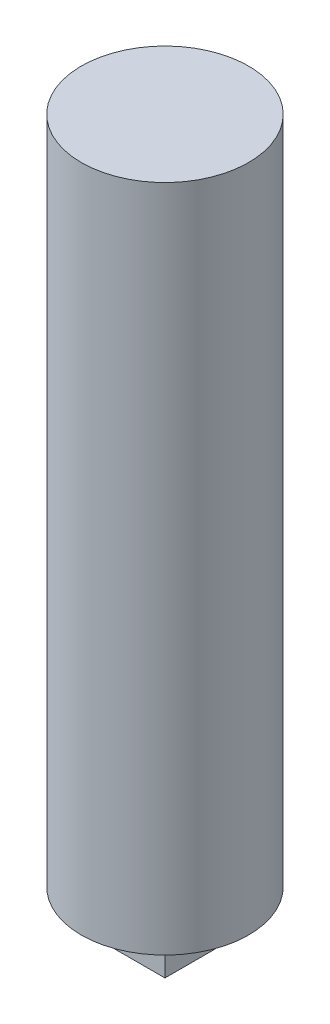
ISO-10303-21;
HEADER;
FILE_DESCRIPTION(('STEP AP214'),'2;1');
FILE_NAME('part.step','',(''),(''),'','','');
FILE_SCHEMA(('AUTOMOTIVE_DESIGN { 1 0 10303 214 1 1 1 1 }'));
ENDSEC;
DATA;
#1=APPLICATION_CONTEXT('core data for automotive mechanical design processes');
#2=APPLICATION_PROTOCOL_DEFINITION('international standard','automotive_design',2000,#1);
#3=PRODUCT_CONTEXT('',#1,'mechanical');
#4=PRODUCT('Part','Part','',(#3));
#5=PRODUCT_RELATED_PRODUCT_CATEGORY('part','',(#4));
#6=PRODUCT_DEFINITION_FORMATION('','',#4);
#7=PRODUCT_DEFINITION_CONTEXT('part definition',#1,'design');
#8=PRODUCT_DEFINITION('design','',#6,#7);
#9=PRODUCT_DEFINITION_SHAPE('','',#8);
#10=(LENGTH_UNIT() NAMED_UNIT(*) SI_UNIT(.MILLI.,.METRE.));
#11=(NAMED_UNIT(*) PLANE_ANGLE_UNIT() SI_UNIT($,.RADIAN.));
#12=(NAMED_UNIT(*) SI_UNIT($,.STERADIAN.) SOLID_ANGLE_UNIT());
#13=UNCERTAINTY_MEASURE_WITH_UNIT(LENGTH_MEASURE(1.E-05),#10,'distance_accuracy_value','');
#14=(GEOMETRIC_REPRESENTATION_CONTEXT(3) GLOBAL_UNCERTAINTY_ASSIGNED_CONTEXT((#13)) GLOBAL_UNIT_ASSIGNED_CONTEXT((#10,
#11,#12)) REPRESENTATION_CONTEXT('',''));
#15=CARTESIAN_POINT('',(0.,0.,0.));
#16=DIRECTION('',(0.,0.,1.));
#17=DIRECTION('',(1.,0.,0.));
#18=AXIS2_PLACEMENT_3D('',#15,#16,#17);
#19=CARTESIAN_POINT('',(0.,1.,0.));
#20=DIRECTION('',(0.,-1.,0.));
#21=DIRECTION('',(0.,0.,-1.));
#22=AXIS2_PLACEMENT_3D('',#19,#20,#21);
#23=PLANE('',#22);
#24=CARTESIAN_POINT('',(0.,1.,0.));
#25=DIRECTION('',(0.,-1.,0.));
#26=DIRECTION('',(0.,0.,-1.));
#27=AXIS2_PLACEMENT_3D('',#24,#25,#26);
#28=CIRCLE('',#27,4.5);
#29=CARTESIAN_POINT('',(0.,1.,-4.5));
#30=VERTEX_POINT('',#29);
#31=EDGE_CURVE('E110',#30,#30,#28,.T.);
#32=ORIENTED_EDGE('',*,*,#31,.T.);
#33=EDGE_LOOP('',(#32));
#34=FACE_BOUND('',#33,.T.);
#35=DIRECTION('',(-1.,0.,0.));
#36=VECTOR('',#35,1.);
#37=CARTESIAN_POINT('',(1.9,1.,1.9));
#38=LINE('',#37,#36);
#39=CARTESIAN_POINT('',(1.9,1.,1.9));
#40=VERTEX_POINT('',#39);
#41=CARTESIAN_POINT('',(-1.9,1.,1.9));
#42=VERTEX_POINT('',#41);
#43=EDGE_CURVE('E88',#40,#42,#38,.T.);
#44=ORIENTED_EDGE('',*,*,#43,.F.);
#45=DIRECTION('',(0.,0.,1.));
#46=VECTOR('',#45,1.);
#47=CARTESIAN_POINT('',(1.9,1.,1.9));
#48=LINE('',#47,#46);
#49=CARTESIAN_POINT('',(1.9,1.,-1.9));
#50=VERTEX_POINT('',#49);
#51=EDGE_CURVE('E99',#50,#40,#48,.T.);
#52=ORIENTED_EDGE('',*,*,#51,.F.);
#53=DIRECTION('',(1.,0.,0.));
#54=VECTOR('',#53,1.);
#55=CARTESIAN_POINT('',(1.9,1.,-1.9));
#56=LINE('',#55,#54);
#57=CARTESIAN_POINT('',(-1.9,1.,-1.9));
#58=VERTEX_POINT('',#57);
#59=EDGE_CURVE('E69',#58,#50,#56,.T.);
#60=ORIENTED_EDGE('',*,*,#59,.F.);
#61=DIRECTION('',(0.,0.,-1.));
#62=VECTOR('',#61,1.);
#63=CARTESIAN_POINT('',(-1.9,1.,1.9));
#64=LINE('',#63,#62);
#65=EDGE_CURVE('E103',#42,#58,#64,.T.);
#66=ORIENTED_EDGE('',*,*,#65,.F.);
#67=EDGE_LOOP('',(#44,#52,#60,#66));
#68=FACE_BOUND('',#67,.T.);
#69=ADVANCED_FACE('F32',(#34,#68),#23,.T.);
#70=CARTESIAN_POINT('',(0.,50.,0.));
#71=DIRECTION('',(0.,-1.,0.));
#72=DIRECTION('',(0.,0.,-1.));
#73=AXIS2_PLACEMENT_3D('',#70,#71,#72);
#74=CYLINDRICAL_SURFACE('',#73,6.25);
#75=CARTESIAN_POINT('',(0.,50.,0.));
#76=DIRECTION('',(0.,1.,0.));
#77=DIRECTION('',(0.,0.,1.));
#78=AXIS2_PLACEMENT_3D('',#75,#76,#77);
#79=CIRCLE('',#78,6.25);
#80=CARTESIAN_POINT('',(0.,50.,6.25));
#81=VERTEX_POINT('',#80);
#82=EDGE_CURVE('E11',#81,#81,#79,.T.);
#83=ORIENTED_EDGE('',*,*,#82,.F.);
#84=EDGE_LOOP('',(#83));
#85=FACE_BOUND('',#84,.T.);
#86=CARTESIAN_POINT('',(0.,0.,0.));
#87=DIRECTION('',(0.,1.,0.));
#88=DIRECTION('',(0.,0.,1.));
#89=AXIS2_PLACEMENT_3D('',#86,#87,#88);
#90=CIRCLE('',#89,6.25);
#91=CARTESIAN_POINT('',(0.,0.,6.25));
#92=VERTEX_POINT('',#91);
#93=EDGE_CURVE('E36',#92,#92,#90,.T.);
#94=ORIENTED_EDGE('',*,*,#93,.T.);
#95=EDGE_LOOP('',(#94));
#96=FACE_BOUND('',#95,.T.);
#97=ADVANCED_FACE('F34',(#85,#96),#74,.T.);
#98=CARTESIAN_POINT('',(0.,50.,0.));
#99=DIRECTION('',(0.,1.,0.));
#100=DIRECTION('',(0.,0.,1.));
#101=AXIS2_PLACEMENT_3D('',#98,#99,#100);
#102=PLANE('',#101);
#103=ORIENTED_EDGE('',*,*,#82,.T.);
#104=EDGE_LOOP('',(#103));
#105=FACE_BOUND('',#104,.T.);
#106=ADVANCED_FACE('F121',(#105),#102,.T.);
#107=CARTESIAN_POINT('',(0.,0.,0.));
#108=DIRECTION('',(0.,1.,0.));
#109=DIRECTION('',(0.,0.,1.));
#110=AXIS2_PLACEMENT_3D('',#107,#108,#109);
#111=PLANE('',#110);
#112=CARTESIAN_POINT('',(0.,0.,0.));
#113=DIRECTION('',(0.,-1.,0.));
#114=DIRECTION('',(0.,0.,-1.));
#115=AXIS2_PLACEMENT_3D('',#112,#113,#114);
#116=CIRCLE('',#115,4.5);
#117=CARTESIAN_POINT('',(0.,0.,-4.5));
#118=VERTEX_POINT('',#117);
#119=EDGE_CURVE('E109',#118,#118,#116,.T.);
#120=ORIENTED_EDGE('',*,*,#119,.F.);
#121=EDGE_LOOP('',(#120));
#122=FACE_BOUND('',#121,.T.);
#123=ORIENTED_EDGE('',*,*,#93,.F.);
#124=EDGE_LOOP('',(#123));
#125=FACE_BOUND('',#124,.T.);
#126=ADVANCED_FACE('F118',(#122,#125),#111,.F.);
#127=CARTESIAN_POINT('',(0.,1.,0.));
#128=DIRECTION('',(0.,-1.,0.));
#129=DIRECTION('',(0.,0.,-1.));
#130=AXIS2_PLACEMENT_3D('',#127,#128,#129);
#131=CYLINDRICAL_SURFACE('',#130,4.5);
#132=ORIENTED_EDGE('',*,*,#31,.F.);
#133=EDGE_LOOP('',(#132));
#134=FACE_BOUND('',#133,.T.);
#135=ORIENTED_EDGE('',*,*,#119,.T.);
#136=EDGE_LOOP('',(#135));
#137=FACE_BOUND('',#136,.T.);
#138=ADVANCED_FACE('F116',(#134,#137),#131,.F.);
#139=CARTESIAN_POINT('',(1.9,-4.,1.9));
#140=DIRECTION('',(-1.,0.,0.));
#141=DIRECTION('',(0.,0.,1.));
#142=AXIS2_PLACEMENT_3D('',#139,#140,#141);
#143=PLANE('',#142);
#144=ORIENTED_EDGE('',*,*,#51,.T.);
#145=DIRECTION('',(0.,1.,0.));
#146=VECTOR('',#145,1.);
#147=CARTESIAN_POINT('',(1.9,-4.,1.9));
#148=LINE('',#147,#146);
#149=CARTESIAN_POINT('',(1.9,-4.,1.9));
#150=VERTEX_POINT('',#149);
#151=EDGE_CURVE('E91',#150,#40,#148,.T.);
#152=ORIENTED_EDGE('',*,*,#151,.F.);
#153=DIRECTION('',(0.,0.,1.));
#154=VECTOR('',#153,1.);
#155=CARTESIAN_POINT('',(1.9,-4.,1.9));
#156=LINE('',#155,#154);
#157=CARTESIAN_POINT('',(1.9,-4.,-1.9));
#158=VERTEX_POINT('',#157);
#159=EDGE_CURVE('E81',#158,#150,#156,.T.);
#160=ORIENTED_EDGE('',*,*,#159,.F.);
#161=DIRECTION('',(0.,1.,0.));
#162=VECTOR('',#161,1.);
#163=CARTESIAN_POINT('',(1.9,-4.,-1.9));
#164=LINE('',#163,#162);
#165=EDGE_CURVE('E95',#158,#50,#164,.T.);
#166=ORIENTED_EDGE('',*,*,#165,.T.);
#167=EDGE_LOOP('',(#144,#152,#160,#166));
#168=FACE_BOUND('',#167,.T.);
#169=ADVANCED_FACE('F141',(#168),#143,.F.);
#170=CARTESIAN_POINT('',(1.9,-4.,1.9));
#171=DIRECTION('',(0.,0.,-1.));
#172=DIRECTION('',(-1.,0.,0.));
#173=AXIS2_PLACEMENT_3D('',#170,#171,#172);
#174=PLANE('',#173);
#175=ORIENTED_EDGE('',*,*,#43,.T.);
#176=DIRECTION('',(0.,1.,0.));
#177=VECTOR('',#176,1.);
#178=CARTESIAN_POINT('',(-1.9,-4.,1.9));
#179=LINE('',#178,#177);
#180=CARTESIAN_POINT('',(-1.9,-4.,1.9));
#181=VERTEX_POINT('',#180);
#182=EDGE_CURVE('E85',#181,#42,#179,.T.);
#183=ORIENTED_EDGE('',*,*,#182,.F.);
#184=DIRECTION('',(-1.,0.,0.));
#185=VECTOR('',#184,1.);
#186=CARTESIAN_POINT('',(1.9,-4.,1.9));
#187=LINE('',#186,#185);
#188=EDGE_CURVE('E76',#150,#181,#187,.T.);
#189=ORIENTED_EDGE('',*,*,#188,.F.);
#190=ORIENTED_EDGE('',*,*,#151,.T.);
#191=EDGE_LOOP('',(#175,#183,#189,#190));
#192=FACE_BOUND('',#191,.T.);
#193=ADVANCED_FACE('F86',(#192),#174,.F.);
#194=CARTESIAN_POINT('',(-1.9,-4.,1.9));
#195=DIRECTION('',(1.,0.,0.));
#196=DIRECTION('',(0.,0.,-1.));
#197=AXIS2_PLACEMENT_3D('',#194,#195,#196);
#198=PLANE('',#197);
#199=ORIENTED_EDGE('',*,*,#65,.T.);
#200=DIRECTION('',(0.,1.,0.));
#201=VECTOR('',#200,1.);
#202=CARTESIAN_POINT('',(-1.9,-4.,-1.9));
#203=LINE('',#202,#201);
#204=CARTESIAN_POINT('',(-1.9,-4.,-1.9));
#205=VERTEX_POINT('',#204);
#206=EDGE_CURVE('E47',#205,#58,#203,.T.);
#207=ORIENTED_EDGE('',*,*,#206,.F.);
#208=DIRECTION('',(0.,0.,-1.));
#209=VECTOR('',#208,1.);
#210=CARTESIAN_POINT('',(-1.9,-4.,1.9));
#211=LINE('',#210,#209);
#212=EDGE_CURVE('E79',#181,#205,#211,.T.);
#213=ORIENTED_EDGE('',*,*,#212,.F.);
#214=ORIENTED_EDGE('',*,*,#182,.T.);
#215=EDGE_LOOP('',(#199,#207,#213,#214));
#216=FACE_BOUND('',#215,.T.);
#217=ADVANCED_FACE('F93',(#216),#198,.F.);
#218=CARTESIAN_POINT('',(1.9,-4.,-1.9));
#219=DIRECTION('',(0.,0.,1.));
#220=DIRECTION('',(1.,0.,0.));
#221=AXIS2_PLACEMENT_3D('',#218,#219,#220);
#222=PLANE('',#221);
#223=ORIENTED_EDGE('',*,*,#59,.T.);
#224=ORIENTED_EDGE('',*,*,#165,.F.);
#225=DIRECTION('',(1.,0.,0.));
#226=VECTOR('',#225,1.);
#227=CARTESIAN_POINT('',(1.9,-4.,-1.9));
#228=LINE('',#227,#226);
#229=EDGE_CURVE('E55',#205,#158,#228,.T.);
#230=ORIENTED_EDGE('',*,*,#229,.F.);
#231=ORIENTED_EDGE('',*,*,#206,.T.);
#232=EDGE_LOOP('',(#223,#224,#230,#231));
#233=FACE_BOUND('',#232,.T.);
#234=ADVANCED_FACE('F154',(#233),#222,.F.);
#235=CARTESIAN_POINT('',(0.,-4.,0.));
#236=DIRECTION('',(0.,1.,0.));
#237=DIRECTION('',(0.,0.,1.));
#238=AXIS2_PLACEMENT_3D('',#235,#236,#237);
#239=PLANE('',#238);
#240=ORIENTED_EDGE('',*,*,#159,.T.);
#241=ORIENTED_EDGE('',*,*,#188,.T.);
#242=ORIENTED_EDGE('',*,*,#212,.T.);
#243=ORIENTED_EDGE('',*,*,#229,.T.);
#244=EDGE_LOOP('',(#240,#241,#242,#243));
#245=FACE_BOUND('',#244,.T.);
#246=ADVANCED_FACE('F77',(#245),#239,.F.);
#247=CLOSED_SHELL('',(#69,#97,#106,#126,#138,#169,#193,#217,#234,#246));
#248=MANIFOLD_SOLID_BREP('B2',#247);
#249=ADVANCED_BREP_SHAPE_REPRESENTATION('',(#18,#248),#14);
#250=SHAPE_DEFINITION_REPRESENTATION(#9,#249);
ENDSEC;
END-ISO-10303-21;
